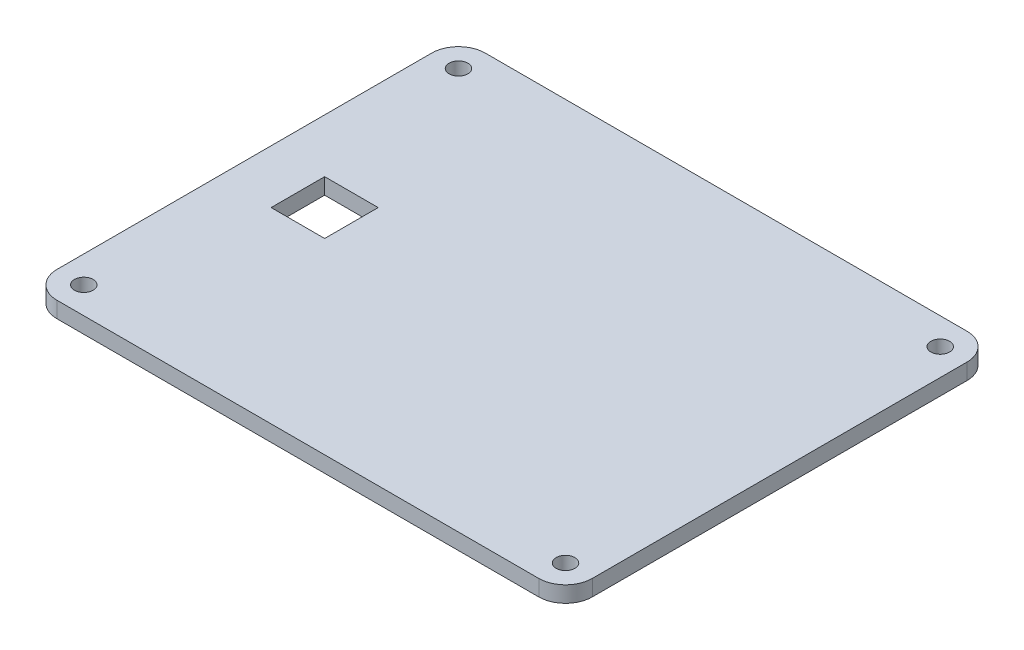
ISO-10303-21;
HEADER;
FILE_DESCRIPTION(('STEP AP214'),'2;1');
FILE_NAME('part.step','',(''),(''),'','','');
FILE_SCHEMA(('AUTOMOTIVE_DESIGN { 1 0 10303 214 1 1 1 1 }'));
ENDSEC;
DATA;
#1=APPLICATION_CONTEXT('core data for automotive mechanical design processes');
#2=APPLICATION_PROTOCOL_DEFINITION('international standard','automotive_design',2000,#1);
#3=PRODUCT_CONTEXT('',#1,'mechanical');
#4=PRODUCT('Part','Part','',(#3));
#5=PRODUCT_RELATED_PRODUCT_CATEGORY('part','',(#4));
#6=PRODUCT_DEFINITION_FORMATION('','',#4);
#7=PRODUCT_DEFINITION_CONTEXT('part definition',#1,'design');
#8=PRODUCT_DEFINITION('design','',#6,#7);
#9=PRODUCT_DEFINITION_SHAPE('','',#8);
#10=(LENGTH_UNIT() NAMED_UNIT(*) SI_UNIT(.MILLI.,.METRE.));
#11=(NAMED_UNIT(*) PLANE_ANGLE_UNIT() SI_UNIT($,.RADIAN.));
#12=(NAMED_UNIT(*) SI_UNIT($,.STERADIAN.) SOLID_ANGLE_UNIT());
#13=UNCERTAINTY_MEASURE_WITH_UNIT(LENGTH_MEASURE(1.E-05),#10,'distance_accuracy_value','');
#14=(GEOMETRIC_REPRESENTATION_CONTEXT(3) GLOBAL_UNCERTAINTY_ASSIGNED_CONTEXT((#13)) GLOBAL_UNIT_ASSIGNED_CONTEXT((#10,
#11,#12)) REPRESENTATION_CONTEXT('',''));
#15=CARTESIAN_POINT('',(0.,0.,0.));
#16=DIRECTION('',(0.,0.,1.));
#17=DIRECTION('',(1.,0.,0.));
#18=AXIS2_PLACEMENT_3D('',#15,#16,#17);
#19=CARTESIAN_POINT('',(45.,3.,-35.));
#20=DIRECTION('',(0.,-1.,0.));
#21=DIRECTION('',(0.,0.,-1.));
#22=AXIS2_PLACEMENT_3D('',#19,#20,#21);
#23=CYLINDRICAL_SURFACE('',#22,5.);
#24=CARTESIAN_POINT('',(45.,0.,-35.));
#25=DIRECTION('',(0.,1.,0.));
#26=DIRECTION('',(0.,0.,-1.));
#27=AXIS2_PLACEMENT_3D('',#24,#25,#26);
#28=CIRCLE('',#27,5.);
#29=CARTESIAN_POINT('',(50.,0.,-35.));
#30=VERTEX_POINT('',#29);
#31=CARTESIAN_POINT('',(45.,0.,-40.));
#32=VERTEX_POINT('',#31);
#33=EDGE_CURVE('E179',#30,#32,#28,.T.);
#34=ORIENTED_EDGE('',*,*,#33,.T.);
#35=DIRECTION('',(0.,-1.,0.));
#36=VECTOR('',#35,1.);
#37=CARTESIAN_POINT('',(45.,3.,-40.));
#38=LINE('',#37,#36);
#39=CARTESIAN_POINT('',(45.,3.,-40.));
#40=VERTEX_POINT('',#39);
#41=EDGE_CURVE('E11',#40,#32,#38,.T.);
#42=ORIENTED_EDGE('',*,*,#41,.F.);
#43=CARTESIAN_POINT('',(45.,3.,-35.));
#44=DIRECTION('',(0.,1.,0.));
#45=DIRECTION('',(0.,0.,-1.));
#46=AXIS2_PLACEMENT_3D('',#43,#44,#45);
#47=CIRCLE('',#46,5.);
#48=CARTESIAN_POINT('',(50.,3.,-35.));
#49=VERTEX_POINT('',#48);
#50=EDGE_CURVE('E182',#49,#40,#47,.T.);
#51=ORIENTED_EDGE('',*,*,#50,.F.);
#52=DIRECTION('',(0.,-1.,0.));
#53=VECTOR('',#52,1.);
#54=CARTESIAN_POINT('',(50.,3.,-35.));
#55=LINE('',#54,#53);
#56=EDGE_CURVE('E200',#49,#30,#55,.T.);
#57=ORIENTED_EDGE('',*,*,#56,.T.);
#58=EDGE_LOOP('',(#34,#42,#51,#57));
#59=FACE_BOUND('',#58,.T.);
#60=ADVANCED_FACE('F33',(#59),#23,.T.);
#61=CARTESIAN_POINT('',(-45.,3.,-40.));
#62=DIRECTION('',(0.,0.,1.));
#63=DIRECTION('',(1.,0.,0.));
#64=AXIS2_PLACEMENT_3D('',#61,#62,#63);
#65=PLANE('',#64);
#66=DIRECTION('',(-1.,0.,0.));
#67=VECTOR('',#66,1.);
#68=CARTESIAN_POINT('',(-45.,0.,-40.));
#69=LINE('',#68,#67);
#70=CARTESIAN_POINT('',(-45.,0.,-40.));
#71=VERTEX_POINT('',#70);
#72=EDGE_CURVE('E203',#32,#71,#69,.T.);
#73=ORIENTED_EDGE('',*,*,#72,.T.);
#74=DIRECTION('',(0.,-1.,0.));
#75=VECTOR('',#74,1.);
#76=CARTESIAN_POINT('',(-45.,3.,-40.));
#77=LINE('',#76,#75);
#78=CARTESIAN_POINT('',(-45.,3.,-40.));
#79=VERTEX_POINT('',#78);
#80=EDGE_CURVE('E40',#79,#71,#77,.T.);
#81=ORIENTED_EDGE('',*,*,#80,.F.);
#82=DIRECTION('',(-1.,0.,0.));
#83=VECTOR('',#82,1.);
#84=CARTESIAN_POINT('',(-45.,3.,-40.));
#85=LINE('',#84,#83);
#86=EDGE_CURVE('E185',#40,#79,#85,.T.);
#87=ORIENTED_EDGE('',*,*,#86,.F.);
#88=ORIENTED_EDGE('',*,*,#41,.T.);
#89=EDGE_LOOP('',(#73,#81,#87,#88));
#90=FACE_BOUND('',#89,.T.);
#91=ADVANCED_FACE('F259',(#90),#65,.F.);
#92=CARTESIAN_POINT('',(-45.,3.,-35.));
#93=DIRECTION('',(0.,-1.,0.));
#94=DIRECTION('',(0.,0.,-1.));
#95=AXIS2_PLACEMENT_3D('',#92,#93,#94);
#96=CYLINDRICAL_SURFACE('',#95,4.99999999999999);
#97=CARTESIAN_POINT('',(-45.,0.,-35.));
#98=DIRECTION('',(0.,1.,0.));
#99=DIRECTION('',(0.,0.,1.));
#100=AXIS2_PLACEMENT_3D('',#97,#98,#99);
#101=CIRCLE('',#100,4.99999999999999);
#102=CARTESIAN_POINT('',(-50.,0.,-35.));
#103=VERTEX_POINT('',#102);
#104=EDGE_CURVE('E205',#71,#103,#101,.T.);
#105=ORIENTED_EDGE('',*,*,#104,.T.);
#106=DIRECTION('',(0.,-1.,0.));
#107=VECTOR('',#106,1.);
#108=CARTESIAN_POINT('',(-50.,3.,-35.));
#109=LINE('',#108,#107);
#110=CARTESIAN_POINT('',(-50.,3.,-35.));
#111=VERTEX_POINT('',#110);
#112=EDGE_CURVE('E230',#111,#103,#109,.T.);
#113=ORIENTED_EDGE('',*,*,#112,.F.);
#114=CARTESIAN_POINT('',(-45.,3.,-35.));
#115=DIRECTION('',(0.,1.,0.));
#116=DIRECTION('',(0.,0.,1.));
#117=AXIS2_PLACEMENT_3D('',#114,#115,#116);
#118=CIRCLE('',#117,4.99999999999999);
#119=EDGE_CURVE('E188',#79,#111,#118,.T.);
#120=ORIENTED_EDGE('',*,*,#119,.F.);
#121=ORIENTED_EDGE('',*,*,#80,.T.);
#122=EDGE_LOOP('',(#105,#113,#120,#121));
#123=FACE_BOUND('',#122,.T.);
#124=ADVANCED_FACE('F237',(#123),#96,.T.);
#125=CARTESIAN_POINT('',(-50.,3.,-35.));
#126=DIRECTION('',(1.,0.,0.));
#127=DIRECTION('',(0.,0.,-1.));
#128=AXIS2_PLACEMENT_3D('',#125,#126,#127);
#129=PLANE('',#128);
#130=DIRECTION('',(0.,0.,1.));
#131=VECTOR('',#130,1.);
#132=CARTESIAN_POINT('',(-50.,0.,-35.));
#133=LINE('',#132,#131);
#134=CARTESIAN_POINT('',(-50.,0.,35.));
#135=VERTEX_POINT('',#134);
#136=EDGE_CURVE('E207',#103,#135,#133,.T.);
#137=ORIENTED_EDGE('',*,*,#136,.T.);
#138=DIRECTION('',(0.,-1.,0.));
#139=VECTOR('',#138,1.);
#140=CARTESIAN_POINT('',(-50.,3.,35.));
#141=LINE('',#140,#139);
#142=CARTESIAN_POINT('',(-50.,3.,35.));
#143=VERTEX_POINT('',#142);
#144=EDGE_CURVE('E227',#143,#135,#141,.T.);
#145=ORIENTED_EDGE('',*,*,#144,.F.);
#146=DIRECTION('',(0.,0.,1.));
#147=VECTOR('',#146,1.);
#148=CARTESIAN_POINT('',(-50.,3.,-35.));
#149=LINE('',#148,#147);
#150=EDGE_CURVE('E190',#111,#143,#149,.T.);
#151=ORIENTED_EDGE('',*,*,#150,.F.);
#152=ORIENTED_EDGE('',*,*,#112,.T.);
#153=EDGE_LOOP('',(#137,#145,#151,#152));
#154=FACE_BOUND('',#153,.T.);
#155=ADVANCED_FACE('F247',(#154),#129,.F.);
#156=CARTESIAN_POINT('',(-45.,3.,35.));
#157=DIRECTION('',(0.,-1.,0.));
#158=DIRECTION('',(0.,0.,-1.));
#159=AXIS2_PLACEMENT_3D('',#156,#157,#158);
#160=CYLINDRICAL_SURFACE('',#159,4.99999999999999);
#161=CARTESIAN_POINT('',(-45.,0.,35.));
#162=DIRECTION('',(0.,1.,0.));
#163=DIRECTION('',(0.,0.,1.));
#164=AXIS2_PLACEMENT_3D('',#161,#162,#163);
#165=CIRCLE('',#164,4.99999999999999);
#166=CARTESIAN_POINT('',(-45.,0.,40.));
#167=VERTEX_POINT('',#166);
#168=EDGE_CURVE('E209',#135,#167,#165,.T.);
#169=ORIENTED_EDGE('',*,*,#168,.T.);
#170=DIRECTION('',(0.,-1.,0.));
#171=VECTOR('',#170,1.);
#172=CARTESIAN_POINT('',(-45.,3.,40.));
#173=LINE('',#172,#171);
#174=CARTESIAN_POINT('',(-45.,3.,40.));
#175=VERTEX_POINT('',#174);
#176=EDGE_CURVE('E224',#175,#167,#173,.T.);
#177=ORIENTED_EDGE('',*,*,#176,.F.);
#178=CARTESIAN_POINT('',(-45.,3.,35.));
#179=DIRECTION('',(0.,1.,0.));
#180=DIRECTION('',(0.,0.,1.));
#181=AXIS2_PLACEMENT_3D('',#178,#179,#180);
#182=CIRCLE('',#181,4.99999999999999);
#183=EDGE_CURVE('E192',#143,#175,#182,.T.);
#184=ORIENTED_EDGE('',*,*,#183,.F.);
#185=ORIENTED_EDGE('',*,*,#144,.T.);
#186=EDGE_LOOP('',(#169,#177,#184,#185));
#187=FACE_BOUND('',#186,.T.);
#188=ADVANCED_FACE('F251',(#187),#160,.T.);
#189=CARTESIAN_POINT('',(-45.,3.,40.));
#190=DIRECTION('',(0.,0.,-1.));
#191=DIRECTION('',(-1.,0.,0.));
#192=AXIS2_PLACEMENT_3D('',#189,#190,#191);
#193=PLANE('',#192);
#194=DIRECTION('',(1.,0.,0.));
#195=VECTOR('',#194,1.);
#196=CARTESIAN_POINT('',(-45.,0.,40.));
#197=LINE('',#196,#195);
#198=CARTESIAN_POINT('',(45.,0.,40.));
#199=VERTEX_POINT('',#198);
#200=EDGE_CURVE('E211',#167,#199,#197,.T.);
#201=ORIENTED_EDGE('',*,*,#200,.T.);
#202=DIRECTION('',(0.,-1.,0.));
#203=VECTOR('',#202,1.);
#204=CARTESIAN_POINT('',(45.,3.,40.));
#205=LINE('',#204,#203);
#206=CARTESIAN_POINT('',(45.,3.,40.));
#207=VERTEX_POINT('',#206);
#208=EDGE_CURVE('E221',#207,#199,#205,.T.);
#209=ORIENTED_EDGE('',*,*,#208,.F.);
#210=DIRECTION('',(1.,0.,0.));
#211=VECTOR('',#210,1.);
#212=CARTESIAN_POINT('',(-45.,3.,40.));
#213=LINE('',#212,#211);
#214=EDGE_CURVE('E194',#175,#207,#213,.T.);
#215=ORIENTED_EDGE('',*,*,#214,.F.);
#216=ORIENTED_EDGE('',*,*,#176,.T.);
#217=EDGE_LOOP('',(#201,#209,#215,#216));
#218=FACE_BOUND('',#217,.T.);
#219=ADVANCED_FACE('F272',(#218),#193,.F.);
#220=CARTESIAN_POINT('',(45.,3.,35.));
#221=DIRECTION('',(0.,-1.,0.));
#222=DIRECTION('',(0.,0.,-1.));
#223=AXIS2_PLACEMENT_3D('',#220,#221,#222);
#224=CYLINDRICAL_SURFACE('',#223,4.99999999999999);
#225=CARTESIAN_POINT('',(45.,0.,35.));
#226=DIRECTION('',(0.,1.,0.));
#227=DIRECTION('',(0.,0.,1.));
#228=AXIS2_PLACEMENT_3D('',#225,#226,#227);
#229=CIRCLE('',#228,4.99999999999999);
#230=CARTESIAN_POINT('',(50.,0.,35.));
#231=VERTEX_POINT('',#230);
#232=EDGE_CURVE('E213',#199,#231,#229,.T.);
#233=ORIENTED_EDGE('',*,*,#232,.T.);
#234=DIRECTION('',(0.,-1.,0.));
#235=VECTOR('',#234,1.);
#236=CARTESIAN_POINT('',(50.,3.,35.));
#237=LINE('',#236,#235);
#238=CARTESIAN_POINT('',(50.,3.,35.));
#239=VERTEX_POINT('',#238);
#240=EDGE_CURVE('E218',#239,#231,#237,.T.);
#241=ORIENTED_EDGE('',*,*,#240,.F.);
#242=CARTESIAN_POINT('',(45.,3.,35.));
#243=DIRECTION('',(0.,1.,0.));
#244=DIRECTION('',(0.,0.,1.));
#245=AXIS2_PLACEMENT_3D('',#242,#243,#244);
#246=CIRCLE('',#245,4.99999999999999);
#247=EDGE_CURVE('E196',#207,#239,#246,.T.);
#248=ORIENTED_EDGE('',*,*,#247,.F.);
#249=ORIENTED_EDGE('',*,*,#208,.T.);
#250=EDGE_LOOP('',(#233,#241,#248,#249));
#251=FACE_BOUND('',#250,.T.);
#252=ADVANCED_FACE('F270',(#251),#224,.T.);
#253=CARTESIAN_POINT('',(50.,3.,-35.));
#254=DIRECTION('',(-1.,0.,0.));
#255=DIRECTION('',(0.,0.,1.));
#256=AXIS2_PLACEMENT_3D('',#253,#254,#255);
#257=PLANE('',#256);
#258=DIRECTION('',(0.,0.,-1.));
#259=VECTOR('',#258,1.);
#260=CARTESIAN_POINT('',(50.,0.,-35.));
#261=LINE('',#260,#259);
#262=EDGE_CURVE('E186',#231,#30,#261,.T.);
#263=ORIENTED_EDGE('',*,*,#262,.T.);
#264=ORIENTED_EDGE('',*,*,#56,.F.);
#265=DIRECTION('',(0.,0.,-1.));
#266=VECTOR('',#265,1.);
#267=CARTESIAN_POINT('',(50.,3.,-35.));
#268=LINE('',#267,#266);
#269=EDGE_CURVE('E198',#239,#49,#268,.T.);
#270=ORIENTED_EDGE('',*,*,#269,.F.);
#271=ORIENTED_EDGE('',*,*,#240,.T.);
#272=EDGE_LOOP('',(#263,#264,#270,#271));
#273=FACE_BOUND('',#272,.T.);
#274=ADVANCED_FACE('F265',(#273),#257,.F.);
#275=CARTESIAN_POINT('',(45.,3.,-35.));
#276=DIRECTION('',(0.,-1.,0.));
#277=DIRECTION('',(0.,0.,-1.));
#278=AXIS2_PLACEMENT_3D('',#275,#276,#277);
#279=PLANE('',#278);
#280=DIRECTION('',(-1.,0.,0.));
#281=VECTOR('',#280,1.);
#282=CARTESIAN_POINT('',(-40.,3.,-5.00000000000002));
#283=LINE('',#282,#281);
#284=CARTESIAN_POINT('',(-30.,3.,-5.00000000000002));
#285=VERTEX_POINT('',#284);
#286=CARTESIAN_POINT('',(-40.,3.,-5.00000000000002));
#287=VERTEX_POINT('',#286);
#288=EDGE_CURVE('E148',#285,#287,#283,.T.);
#289=ORIENTED_EDGE('',*,*,#288,.F.);
#290=DIRECTION('',(0.,0.,-1.));
#291=VECTOR('',#290,1.);
#292=CARTESIAN_POINT('',(-30.,3.,-5.00000000000002));
#293=LINE('',#292,#291);
#294=CARTESIAN_POINT('',(-30.,3.,4.99999999999998));
#295=VERTEX_POINT('',#294);
#296=EDGE_CURVE('E47',#295,#285,#293,.T.);
#297=ORIENTED_EDGE('',*,*,#296,.F.);
#298=DIRECTION('',(1.,0.,0.));
#299=VECTOR('',#298,1.);
#300=CARTESIAN_POINT('',(-40.,3.,4.99999999999998));
#301=LINE('',#300,#299);
#302=CARTESIAN_POINT('',(-40.,3.,4.99999999999998));
#303=VERTEX_POINT('',#302);
#304=EDGE_CURVE('E139',#303,#295,#301,.T.);
#305=ORIENTED_EDGE('',*,*,#304,.F.);
#306=DIRECTION('',(0.,0.,1.));
#307=VECTOR('',#306,1.);
#308=CARTESIAN_POINT('',(-40.,3.,-5.00000000000002));
#309=LINE('',#308,#307);
#310=EDGE_CURVE('E142',#287,#303,#309,.T.);
#311=ORIENTED_EDGE('',*,*,#310,.F.);
#312=EDGE_LOOP('',(#289,#297,#305,#311));
#313=FACE_BOUND('',#312,.T.);
#314=CARTESIAN_POINT('',(45.,3.,35.));
#315=DIRECTION('',(0.,1.,0.));
#316=DIRECTION('',(0.,0.,1.));
#317=AXIS2_PLACEMENT_3D('',#314,#315,#316);
#318=CIRCLE('',#317,1.75);
#319=CARTESIAN_POINT('',(45.,3.,36.75));
#320=VERTEX_POINT('',#319);
#321=EDGE_CURVE('E162',#320,#320,#318,.T.);
#322=ORIENTED_EDGE('',*,*,#321,.F.);
#323=EDGE_LOOP('',(#322));
#324=FACE_BOUND('',#323,.T.);
#325=CARTESIAN_POINT('',(-45.,3.,-35.));
#326=DIRECTION('',(0.,1.,0.));
#327=DIRECTION('',(0.,0.,1.));
#328=AXIS2_PLACEMENT_3D('',#325,#326,#327);
#329=CIRCLE('',#328,1.75);
#330=CARTESIAN_POINT('',(-45.,3.,-33.25));
#331=VERTEX_POINT('',#330);
#332=EDGE_CURVE('E168',#331,#331,#329,.T.);
#333=ORIENTED_EDGE('',*,*,#332,.F.);
#334=EDGE_LOOP('',(#333));
#335=FACE_BOUND('',#334,.T.);
#336=CARTESIAN_POINT('',(45.,3.,-35.));
#337=DIRECTION('',(0.,1.,0.));
#338=DIRECTION('',(0.,0.,1.));
#339=AXIS2_PLACEMENT_3D('',#336,#337,#338);
#340=CIRCLE('',#339,1.75);
#341=CARTESIAN_POINT('',(45.,3.,-33.25));
#342=VERTEX_POINT('',#341);
#343=EDGE_CURVE('E154',#342,#342,#340,.T.);
#344=ORIENTED_EDGE('',*,*,#343,.F.);
#345=EDGE_LOOP('',(#344));
#346=FACE_BOUND('',#345,.T.);
#347=CARTESIAN_POINT('',(-45.,3.,35.));
#348=DIRECTION('',(0.,1.,0.));
#349=DIRECTION('',(0.,0.,1.));
#350=AXIS2_PLACEMENT_3D('',#347,#348,#349);
#351=CIRCLE('',#350,1.75);
#352=CARTESIAN_POINT('',(-45.,3.,36.75));
#353=VERTEX_POINT('',#352);
#354=EDGE_CURVE('E161',#353,#353,#351,.T.);
#355=ORIENTED_EDGE('',*,*,#354,.F.);
#356=EDGE_LOOP('',(#355));
#357=FACE_BOUND('',#356,.T.);
#358=ORIENTED_EDGE('',*,*,#50,.T.);
#359=ORIENTED_EDGE('',*,*,#86,.T.);
#360=ORIENTED_EDGE('',*,*,#119,.T.);
#361=ORIENTED_EDGE('',*,*,#150,.T.);
#362=ORIENTED_EDGE('',*,*,#183,.T.);
#363=ORIENTED_EDGE('',*,*,#214,.T.);
#364=ORIENTED_EDGE('',*,*,#247,.T.);
#365=ORIENTED_EDGE('',*,*,#269,.T.);
#366=EDGE_LOOP('',(#358,#359,#360,#361,#362,#363,#364,#365));
#367=FACE_BOUND('',#366,.T.);
#368=ADVANCED_FACE('F255',(#313,#324,#335,#346,#357,#367),#279,.F.);
#369=CARTESIAN_POINT('',(45.,0.,-35.));
#370=DIRECTION('',(0.,-1.,0.));
#371=DIRECTION('',(0.,0.,-1.));
#372=AXIS2_PLACEMENT_3D('',#369,#370,#371);
#373=PLANE('',#372);
#374=DIRECTION('',(0.,0.,-1.));
#375=VECTOR('',#374,1.);
#376=CARTESIAN_POINT('',(-30.,0.,-5.00000000000002));
#377=LINE('',#376,#375);
#378=CARTESIAN_POINT('',(-30.,0.,4.99999999999998));
#379=VERTEX_POINT('',#378);
#380=CARTESIAN_POINT('',(-30.,0.,-5.00000000000002));
#381=VERTEX_POINT('',#380);
#382=EDGE_CURVE('E123',#379,#381,#377,.T.);
#383=ORIENTED_EDGE('',*,*,#382,.T.);
#384=DIRECTION('',(-1.,0.,0.));
#385=VECTOR('',#384,1.);
#386=CARTESIAN_POINT('',(-40.,0.,-5.00000000000002));
#387=LINE('',#386,#385);
#388=CARTESIAN_POINT('',(-40.,0.,-5.00000000000002));
#389=VERTEX_POINT('',#388);
#390=EDGE_CURVE('E132',#381,#389,#387,.T.);
#391=ORIENTED_EDGE('',*,*,#390,.T.);
#392=DIRECTION('',(0.,0.,1.));
#393=VECTOR('',#392,1.);
#394=CARTESIAN_POINT('',(-40.,0.,-5.00000000000002));
#395=LINE('',#394,#393);
#396=CARTESIAN_POINT('',(-40.,0.,4.99999999999998));
#397=VERTEX_POINT('',#396);
#398=EDGE_CURVE('E55',#389,#397,#395,.T.);
#399=ORIENTED_EDGE('',*,*,#398,.T.);
#400=DIRECTION('',(1.,0.,0.));
#401=VECTOR('',#400,1.);
#402=CARTESIAN_POINT('',(-40.,0.,4.99999999999998));
#403=LINE('',#402,#401);
#404=EDGE_CURVE('E129',#397,#379,#403,.T.);
#405=ORIENTED_EDGE('',*,*,#404,.T.);
#406=EDGE_LOOP('',(#383,#391,#399,#405));
#407=FACE_BOUND('',#406,.T.);
#408=CARTESIAN_POINT('',(45.,0.,35.));
#409=DIRECTION('',(0.,1.,0.));
#410=DIRECTION('',(0.,0.,1.));
#411=AXIS2_PLACEMENT_3D('',#408,#409,#410);
#412=CIRCLE('',#411,1.75);
#413=CARTESIAN_POINT('',(45.,0.,36.75));
#414=VERTEX_POINT('',#413);
#415=EDGE_CURVE('E158',#414,#414,#412,.T.);
#416=ORIENTED_EDGE('',*,*,#415,.T.);
#417=EDGE_LOOP('',(#416));
#418=FACE_BOUND('',#417,.T.);
#419=CARTESIAN_POINT('',(-45.,0.,-35.));
#420=DIRECTION('',(0.,1.,0.));
#421=DIRECTION('',(0.,0.,1.));
#422=AXIS2_PLACEMENT_3D('',#419,#420,#421);
#423=CIRCLE('',#422,1.75);
#424=CARTESIAN_POINT('',(-45.,0.,-33.25));
#425=VERTEX_POINT('',#424);
#426=EDGE_CURVE('E165',#425,#425,#423,.T.);
#427=ORIENTED_EDGE('',*,*,#426,.T.);
#428=EDGE_LOOP('',(#427));
#429=FACE_BOUND('',#428,.T.);
#430=CARTESIAN_POINT('',(45.,0.,-35.));
#431=DIRECTION('',(0.,1.,0.));
#432=DIRECTION('',(0.,0.,1.));
#433=AXIS2_PLACEMENT_3D('',#430,#431,#432);
#434=CIRCLE('',#433,1.75);
#435=CARTESIAN_POINT('',(45.,0.,-33.25));
#436=VERTEX_POINT('',#435);
#437=EDGE_CURVE('E171',#436,#436,#434,.T.);
#438=ORIENTED_EDGE('',*,*,#437,.T.);
#439=EDGE_LOOP('',(#438));
#440=FACE_BOUND('',#439,.T.);
#441=CARTESIAN_POINT('',(-45.,0.,35.));
#442=DIRECTION('',(0.,1.,0.));
#443=DIRECTION('',(0.,0.,1.));
#444=AXIS2_PLACEMENT_3D('',#441,#442,#443);
#445=CIRCLE('',#444,1.75);
#446=CARTESIAN_POINT('',(-45.,0.,36.75));
#447=VERTEX_POINT('',#446);
#448=EDGE_CURVE('E176',#447,#447,#445,.T.);
#449=ORIENTED_EDGE('',*,*,#448,.T.);
#450=EDGE_LOOP('',(#449));
#451=FACE_BOUND('',#450,.T.);
#452=ORIENTED_EDGE('',*,*,#33,.F.);
#453=ORIENTED_EDGE('',*,*,#262,.F.);
#454=ORIENTED_EDGE('',*,*,#232,.F.);
#455=ORIENTED_EDGE('',*,*,#200,.F.);
#456=ORIENTED_EDGE('',*,*,#168,.F.);
#457=ORIENTED_EDGE('',*,*,#136,.F.);
#458=ORIENTED_EDGE('',*,*,#104,.F.);
#459=ORIENTED_EDGE('',*,*,#72,.F.);
#460=EDGE_LOOP('',(#452,#453,#454,#455,#456,#457,#458,#459));
#461=FACE_BOUND('',#460,.T.);
#462=ADVANCED_FACE('F136',(#407,#418,#429,#440,#451,#461),#373,.T.);
#463=CARTESIAN_POINT('',(-45.,0.,35.));
#464=DIRECTION('',(0.,1.,0.));
#465=DIRECTION('',(0.,0.,1.));
#466=AXIS2_PLACEMENT_3D('',#463,#464,#465);
#467=CYLINDRICAL_SURFACE('',#466,1.75);
#468=ORIENTED_EDGE('',*,*,#448,.F.);
#469=EDGE_LOOP('',(#468));
#470=FACE_BOUND('',#469,.T.);
#471=ORIENTED_EDGE('',*,*,#354,.T.);
#472=EDGE_LOOP('',(#471));
#473=FACE_BOUND('',#472,.T.);
#474=ADVANCED_FACE('F324',(#470,#473),#467,.F.);
#475=CARTESIAN_POINT('',(45.,0.,-35.));
#476=DIRECTION('',(0.,1.,0.));
#477=DIRECTION('',(0.,0.,1.));
#478=AXIS2_PLACEMENT_3D('',#475,#476,#477);
#479=CYLINDRICAL_SURFACE('',#478,1.75);
#480=ORIENTED_EDGE('',*,*,#437,.F.);
#481=EDGE_LOOP('',(#480));
#482=FACE_BOUND('',#481,.T.);
#483=ORIENTED_EDGE('',*,*,#343,.T.);
#484=EDGE_LOOP('',(#483));
#485=FACE_BOUND('',#484,.T.);
#486=ADVANCED_FACE('F329',(#482,#485),#479,.F.);
#487=CARTESIAN_POINT('',(-45.,0.,-35.));
#488=DIRECTION('',(0.,1.,0.));
#489=DIRECTION('',(0.,0.,1.));
#490=AXIS2_PLACEMENT_3D('',#487,#488,#489);
#491=CYLINDRICAL_SURFACE('',#490,1.75);
#492=ORIENTED_EDGE('',*,*,#426,.F.);
#493=EDGE_LOOP('',(#492));
#494=FACE_BOUND('',#493,.T.);
#495=ORIENTED_EDGE('',*,*,#332,.T.);
#496=EDGE_LOOP('',(#495));
#497=FACE_BOUND('',#496,.T.);
#498=ADVANCED_FACE('F341',(#494,#497),#491,.F.);
#499=CARTESIAN_POINT('',(45.,0.,35.));
#500=DIRECTION('',(0.,1.,0.));
#501=DIRECTION('',(0.,0.,1.));
#502=AXIS2_PLACEMENT_3D('',#499,#500,#501);
#503=CYLINDRICAL_SURFACE('',#502,1.75);
#504=ORIENTED_EDGE('',*,*,#415,.F.);
#505=EDGE_LOOP('',(#504));
#506=FACE_BOUND('',#505,.T.);
#507=ORIENTED_EDGE('',*,*,#321,.T.);
#508=EDGE_LOOP('',(#507));
#509=FACE_BOUND('',#508,.T.);
#510=ADVANCED_FACE('F351',(#506,#509),#503,.F.);
#511=CARTESIAN_POINT('',(-30.,0.,-5.00000000000002));
#512=DIRECTION('',(1.,0.,0.));
#513=DIRECTION('',(0.,0.,-1.));
#514=AXIS2_PLACEMENT_3D('',#511,#512,#513);
#515=PLANE('',#514);
#516=ORIENTED_EDGE('',*,*,#296,.T.);
#517=DIRECTION('',(0.,1.,0.));
#518=VECTOR('',#517,1.);
#519=CARTESIAN_POINT('',(-30.,0.,-5.00000000000002));
#520=LINE('',#519,#518);
#521=EDGE_CURVE('E119',#381,#285,#520,.T.);
#522=ORIENTED_EDGE('',*,*,#521,.F.);
#523=ORIENTED_EDGE('',*,*,#382,.F.);
#524=DIRECTION('',(0.,1.,0.));
#525=VECTOR('',#524,1.);
#526=CARTESIAN_POINT('',(-30.,0.,4.99999999999998));
#527=LINE('',#526,#525);
#528=EDGE_CURVE('E152',#379,#295,#527,.T.);
#529=ORIENTED_EDGE('',*,*,#528,.T.);
#530=EDGE_LOOP('',(#516,#522,#523,#529));
#531=FACE_BOUND('',#530,.T.);
#532=ADVANCED_FACE('F121',(#531),#515,.F.);
#533=CARTESIAN_POINT('',(-40.,0.,4.99999999999998));
#534=DIRECTION('',(0.,0.,1.));
#535=DIRECTION('',(1.,0.,0.));
#536=AXIS2_PLACEMENT_3D('',#533,#534,#535);
#537=PLANE('',#536);
#538=ORIENTED_EDGE('',*,*,#304,.T.);
#539=ORIENTED_EDGE('',*,*,#528,.F.);
#540=ORIENTED_EDGE('',*,*,#404,.F.);
#541=DIRECTION('',(0.,1.,0.));
#542=VECTOR('',#541,1.);
#543=CARTESIAN_POINT('',(-40.,0.,4.99999999999998));
#544=LINE('',#543,#542);
#545=EDGE_CURVE('E155',#397,#303,#544,.T.);
#546=ORIENTED_EDGE('',*,*,#545,.T.);
#547=EDGE_LOOP('',(#538,#539,#540,#546));
#548=FACE_BOUND('',#547,.T.);
#549=ADVANCED_FACE('F383',(#548),#537,.F.);
#550=CARTESIAN_POINT('',(-40.,0.,-5.00000000000002));
#551=DIRECTION('',(-1.,0.,0.));
#552=DIRECTION('',(0.,0.,1.));
#553=AXIS2_PLACEMENT_3D('',#550,#551,#552);
#554=PLANE('',#553);
#555=ORIENTED_EDGE('',*,*,#310,.T.);
#556=ORIENTED_EDGE('',*,*,#545,.F.);
#557=ORIENTED_EDGE('',*,*,#398,.F.);
#558=DIRECTION('',(0.,1.,0.));
#559=VECTOR('',#558,1.);
#560=CARTESIAN_POINT('',(-40.,0.,-5.00000000000002));
#561=LINE('',#560,#559);
#562=EDGE_CURVE('E128',#389,#287,#561,.T.);
#563=ORIENTED_EDGE('',*,*,#562,.T.);
#564=EDGE_LOOP('',(#555,#556,#557,#563));
#565=FACE_BOUND('',#564,.T.);
#566=ADVANCED_FACE('F392',(#565),#554,.F.);
#567=CARTESIAN_POINT('',(-40.,0.,-5.00000000000002));
#568=DIRECTION('',(0.,0.,-1.));
#569=DIRECTION('',(-1.,0.,0.));
#570=AXIS2_PLACEMENT_3D('',#567,#568,#569);
#571=PLANE('',#570);
#572=ORIENTED_EDGE('',*,*,#288,.T.);
#573=ORIENTED_EDGE('',*,*,#562,.F.);
#574=ORIENTED_EDGE('',*,*,#390,.F.);
#575=ORIENTED_EDGE('',*,*,#521,.T.);
#576=EDGE_LOOP('',(#572,#573,#574,#575));
#577=FACE_BOUND('',#576,.T.);
#578=ADVANCED_FACE('F133',(#577),#571,.F.);
#579=CLOSED_SHELL('',(#60,#91,#124,#155,#188,#219,#252,#274,#368,#462,#474,#486,#498,#510,#532,
#549,#566,#578));
#580=MANIFOLD_SOLID_BREP('B2',#579);
#581=ADVANCED_BREP_SHAPE_REPRESENTATION('',(#18,#580),#14);
#582=SHAPE_DEFINITION_REPRESENTATION(#9,#581);
ENDSEC;
END-ISO-10303-21;
